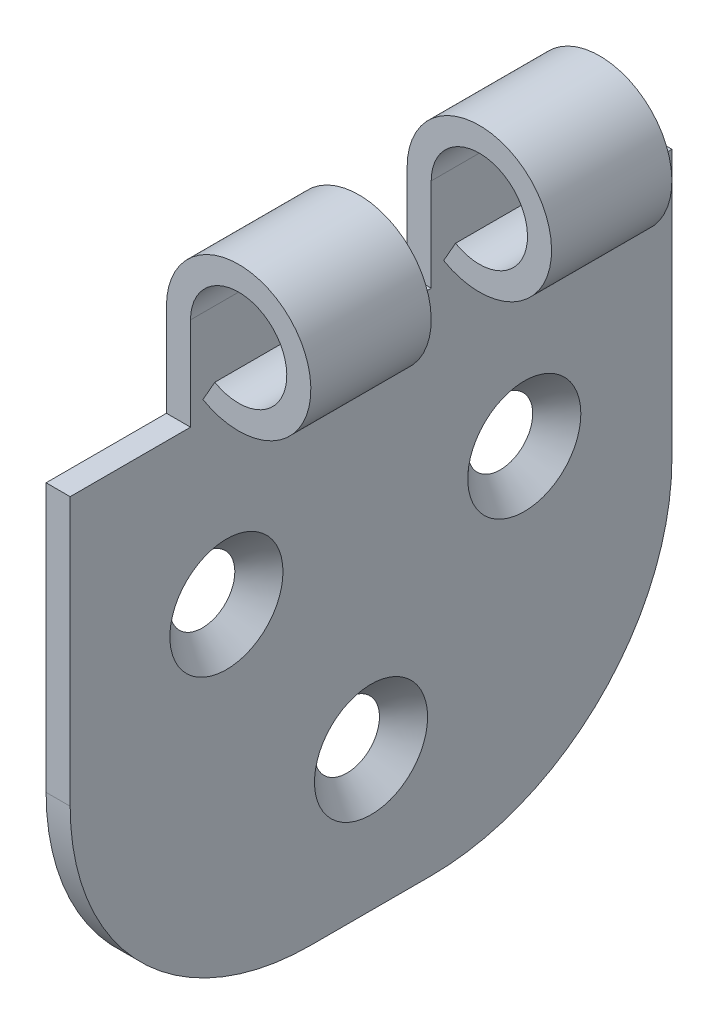
ISO-10303-21;
HEADER;
FILE_DESCRIPTION(('STEP AP214'),'2;1');
FILE_NAME('part.step','',(''),(''),'','','');
FILE_SCHEMA(('AUTOMOTIVE_DESIGN { 1 0 10303 214 1 1 1 1 }'));
ENDSEC;
DATA;
#1=APPLICATION_CONTEXT('core data for automotive mechanical design processes');
#2=APPLICATION_PROTOCOL_DEFINITION('international standard','automotive_design',2000,#1);
#3=PRODUCT_CONTEXT('',#1,'mechanical');
#4=PRODUCT('Part','Part','',(#3));
#5=PRODUCT_RELATED_PRODUCT_CATEGORY('part','',(#4));
#6=PRODUCT_DEFINITION_FORMATION('','',#4);
#7=PRODUCT_DEFINITION_CONTEXT('part definition',#1,'design');
#8=PRODUCT_DEFINITION('design','',#6,#7);
#9=PRODUCT_DEFINITION_SHAPE('','',#8);
#10=(LENGTH_UNIT() NAMED_UNIT(*) SI_UNIT(.MILLI.,.METRE.));
#11=(NAMED_UNIT(*) PLANE_ANGLE_UNIT() SI_UNIT($,.RADIAN.));
#12=(NAMED_UNIT(*) SI_UNIT($,.STERADIAN.) SOLID_ANGLE_UNIT());
#13=UNCERTAINTY_MEASURE_WITH_UNIT(LENGTH_MEASURE(1.E-05),#10,'distance_accuracy_value','');
#14=(GEOMETRIC_REPRESENTATION_CONTEXT(3) GLOBAL_UNCERTAINTY_ASSIGNED_CONTEXT((#13)) GLOBAL_UNIT_ASSIGNED_CONTEXT((#10,
#11,#12)) REPRESENTATION_CONTEXT('',''));
#15=CARTESIAN_POINT('',(0.,0.,0.));
#16=DIRECTION('',(0.,0.,1.));
#17=DIRECTION('',(1.,0.,0.));
#18=AXIS2_PLACEMENT_3D('',#15,#16,#17);
#19=CARTESIAN_POINT('',(1.99999999999999,50.,25.));
#20=DIRECTION('',(-1.,0.,0.));
#21=DIRECTION('',(0.,-1.,0.));
#22=AXIS2_PLACEMENT_3D('',#19,#20,#21);
#23=PLANE('',#22);
#24=CARTESIAN_POINT('',(2.,28.0397626935268,12.0173285585912));
#25=DIRECTION('',(1.,0.,0.));
#26=DIRECTION('',(0.,0.,-1.));
#27=AXIS2_PLACEMENT_3D('',#24,#25,#26);
#28=CIRCLE('',#27,4.7);
#29=CARTESIAN_POINT('',(2.,28.0397626935268,7.3173285585912));
#30=VERTEX_POINT('',#29);
#31=EDGE_CURVE('E309',#30,#30,#28,.T.);
#32=ORIENTED_EDGE('',*,*,#31,.F.);
#33=EDGE_LOOP('',(#32));
#34=FACE_BOUND('',#33,.T.);
#35=CARTESIAN_POINT('',(2.,27.0383186469775,-12.7326457346978));
#36=DIRECTION('',(1.,0.,0.));
#37=DIRECTION('',(0.,0.,-1.));
#38=AXIS2_PLACEMENT_3D('',#35,#36,#37);
#39=CIRCLE('',#38,4.7);
#40=CARTESIAN_POINT('',(2.,27.0383186469775,-17.4326457346978));
#41=VERTEX_POINT('',#40);
#42=EDGE_CURVE('E203',#41,#41,#39,.T.);
#43=ORIENTED_EDGE('',*,*,#42,.F.);
#44=EDGE_LOOP('',(#43));
#45=FACE_BOUND('',#44,.T.);
#46=DIRECTION('',(0.,0.,-1.));
#47=VECTOR('',#46,1.);
#48=CARTESIAN_POINT('',(2.,0.,25.));
#49=LINE('',#48,#47);
#50=CARTESIAN_POINT('',(2.,0.,5.));
#51=VERTEX_POINT('',#50);
#52=CARTESIAN_POINT('',(2.,0.,-5.));
#53=VERTEX_POINT('',#52);
#54=EDGE_CURVE('E284',#51,#53,#49,.T.);
#55=ORIENTED_EDGE('',*,*,#54,.T.);
#56=CARTESIAN_POINT('',(2.,20.,-5.));
#57=DIRECTION('',(-1.,0.,0.));
#58=DIRECTION('',(0.,-1.,0.));
#59=AXIS2_PLACEMENT_3D('',#56,#57,#58);
#60=CIRCLE('',#59,20.);
#61=CARTESIAN_POINT('',(2.,20.,-25.));
#62=VERTEX_POINT('',#61);
#63=EDGE_CURVE('E301',#53,#62,#60,.F.);
#64=ORIENTED_EDGE('',*,*,#63,.T.);
#65=DIRECTION('',(0.,1.,0.));
#66=VECTOR('',#65,1.);
#67=CARTESIAN_POINT('',(1.99999999999999,50.,-25.));
#68=LINE('',#67,#66);
#69=CARTESIAN_POINT('',(1.99999999999999,42.2789868146542,-25.));
#70=VERTEX_POINT('',#69);
#71=EDGE_CURVE('E258',#62,#70,#68,.T.);
#72=ORIENTED_EDGE('',*,*,#71,.T.);
#73=DIRECTION('',(0.,0.,-1.));
#74=VECTOR('',#73,1.);
#75=CARTESIAN_POINT('',(1.99999999999999,42.2789868146542,25.));
#76=LINE('',#75,#74);
#77=CARTESIAN_POINT('',(1.99999999999999,42.2789868146542,-15.));
#78=VERTEX_POINT('',#77);
#79=EDGE_CURVE('E186',#78,#70,#76,.T.);
#80=ORIENTED_EDGE('',*,*,#79,.F.);
#81=DIRECTION('',(0.,-1.,0.));
#82=VECTOR('',#81,1.);
#83=CARTESIAN_POINT('',(1.99999999999999,50.,-15.));
#84=LINE('',#83,#82);
#85=CARTESIAN_POINT('',(1.99999999999999,50.,-15.));
#86=VERTEX_POINT('',#85);
#87=EDGE_CURVE('E231',#86,#78,#84,.T.);
#88=ORIENTED_EDGE('',*,*,#87,.F.);
#89=DIRECTION('',(0.,0.,-1.));
#90=VECTOR('',#89,1.);
#91=CARTESIAN_POINT('',(1.99999999999999,50.,25.));
#92=LINE('',#91,#90);
#93=CARTESIAN_POINT('',(1.99999999999999,50.,-5.));
#94=VERTEX_POINT('',#93);
#95=EDGE_CURVE('E280',#94,#86,#92,.T.);
#96=ORIENTED_EDGE('',*,*,#95,.F.);
#97=DIRECTION('',(0.,1.,0.));
#98=VECTOR('',#97,1.);
#99=CARTESIAN_POINT('',(1.99999999999999,50.,-5.));
#100=LINE('',#99,#98);
#101=CARTESIAN_POINT('',(1.99999999999999,42.2789868146542,-5.));
#102=VERTEX_POINT('',#101);
#103=EDGE_CURVE('E239',#102,#94,#100,.T.);
#104=ORIENTED_EDGE('',*,*,#103,.F.);
#105=DIRECTION('',(0.,0.,-1.));
#106=VECTOR('',#105,1.);
#107=CARTESIAN_POINT('',(1.99999999999999,42.2789868146542,25.));
#108=LINE('',#107,#106);
#109=CARTESIAN_POINT('',(1.99999999999999,42.2789868146542,5.));
#110=VERTEX_POINT('',#109);
#111=EDGE_CURVE('E241',#110,#102,#108,.T.);
#112=ORIENTED_EDGE('',*,*,#111,.F.);
#113=DIRECTION('',(0.,-1.,0.));
#114=VECTOR('',#113,1.);
#115=CARTESIAN_POINT('',(1.99999999999999,50.,5.));
#116=LINE('',#115,#114);
#117=CARTESIAN_POINT('',(1.99999999999999,50.,5.));
#118=VERTEX_POINT('',#117);
#119=EDGE_CURVE('E249',#118,#110,#116,.T.);
#120=ORIENTED_EDGE('',*,*,#119,.F.);
#121=CARTESIAN_POINT('',(1.99999999999999,50.,15.));
#122=VERTEX_POINT('',#121);
#123=EDGE_CURVE('E283',#122,#118,#92,.T.);
#124=ORIENTED_EDGE('',*,*,#123,.F.);
#125=DIRECTION('',(0.,1.,0.));
#126=VECTOR('',#125,1.);
#127=CARTESIAN_POINT('',(1.99999999999999,50.,15.));
#128=LINE('',#127,#126);
#129=CARTESIAN_POINT('',(1.99999999999999,42.2789868146542,15.));
#130=VERTEX_POINT('',#129);
#131=EDGE_CURVE('E256',#130,#122,#128,.T.);
#132=ORIENTED_EDGE('',*,*,#131,.F.);
#133=DIRECTION('',(0.,0.,-1.));
#134=VECTOR('',#133,1.);
#135=CARTESIAN_POINT('',(1.99999999999999,42.2789868146542,25.));
#136=LINE('',#135,#134);
#137=CARTESIAN_POINT('',(2.,42.2789868146542,25.));
#138=VERTEX_POINT('',#137);
#139=EDGE_CURVE('E183',#138,#130,#136,.T.);
#140=ORIENTED_EDGE('',*,*,#139,.F.);
#141=DIRECTION('',(0.,1.,0.));
#142=VECTOR('',#141,1.);
#143=CARTESIAN_POINT('',(1.99999999999999,50.,25.));
#144=LINE('',#143,#142);
#145=CARTESIAN_POINT('',(2.,20.,25.));
#146=VERTEX_POINT('',#145);
#147=EDGE_CURVE('E259',#146,#138,#144,.T.);
#148=ORIENTED_EDGE('',*,*,#147,.F.);
#149=CARTESIAN_POINT('',(2.,20.,5.));
#150=DIRECTION('',(-1.,0.,0.));
#151=DIRECTION('',(0.,-1.,0.));
#152=AXIS2_PLACEMENT_3D('',#149,#150,#151);
#153=CIRCLE('',#152,20.);
#154=EDGE_CURVE('E299',#146,#51,#153,.F.);
#155=ORIENTED_EDGE('',*,*,#154,.T.);
#156=EDGE_LOOP('',(#55,#64,#72,#80,#88,#96,#104,#112,#120,#124,#132,#140,#148,#155));
#157=FACE_BOUND('',#156,.T.);
#158=CARTESIAN_POINT('',(2.,11.5874676430746,0.));
#159=DIRECTION('',(1.,0.,0.));
#160=DIRECTION('',(0.,0.,-1.));
#161=AXIS2_PLACEMENT_3D('',#158,#159,#160);
#162=CIRCLE('',#161,4.7);
#163=CARTESIAN_POINT('',(2.,11.5874676430746,-4.7));
#164=VERTEX_POINT('',#163);
#165=EDGE_CURVE('E317',#164,#164,#162,.T.);
#166=ORIENTED_EDGE('',*,*,#165,.F.);
#167=EDGE_LOOP('',(#166));
#168=FACE_BOUND('',#167,.T.);
#169=ADVANCED_FACE('F45',(#34,#45,#157,#168),#23,.F.);
#170=CARTESIAN_POINT('',(0.,0.,25.));
#171=DIRECTION('',(1.,0.,0.));
#172=DIRECTION('',(0.,0.,-1.));
#173=AXIS2_PLACEMENT_3D('',#170,#171,#172);
#174=PLANE('',#173);
#175=CARTESIAN_POINT('',(0.,11.5874676430746,0.));
#176=DIRECTION('',(1.,0.,0.));
#177=DIRECTION('',(0.,0.,-1.));
#178=AXIS2_PLACEMENT_3D('',#175,#176,#177);
#179=CIRCLE('',#178,2.7);
#180=CARTESIAN_POINT('',(0.,11.5874676430746,-2.7));
#181=VERTEX_POINT('',#180);
#182=EDGE_CURVE('E49',#181,#181,#179,.T.);
#183=ORIENTED_EDGE('',*,*,#182,.T.);
#184=EDGE_LOOP('',(#183));
#185=FACE_BOUND('',#184,.T.);
#186=CARTESIAN_POINT('',(0.,28.0397626935268,12.0173285585912));
#187=DIRECTION('',(1.,0.,0.));
#188=DIRECTION('',(0.,0.,-1.));
#189=AXIS2_PLACEMENT_3D('',#186,#187,#188);
#190=CIRCLE('',#189,2.7);
#191=CARTESIAN_POINT('',(0.,28.0397626935268,9.3173285585912));
#192=VERTEX_POINT('',#191);
#193=EDGE_CURVE('E307',#192,#192,#190,.T.);
#194=ORIENTED_EDGE('',*,*,#193,.T.);
#195=EDGE_LOOP('',(#194));
#196=FACE_BOUND('',#195,.T.);
#197=CARTESIAN_POINT('',(0.,27.0383186469775,-12.7326457346978));
#198=DIRECTION('',(1.,0.,0.));
#199=DIRECTION('',(0.,0.,-1.));
#200=AXIS2_PLACEMENT_3D('',#197,#198,#199);
#201=CIRCLE('',#200,2.7);
#202=CARTESIAN_POINT('',(0.,27.0383186469775,-15.4326457346978));
#203=VERTEX_POINT('',#202);
#204=EDGE_CURVE('E218',#203,#203,#201,.T.);
#205=ORIENTED_EDGE('',*,*,#204,.T.);
#206=EDGE_LOOP('',(#205));
#207=FACE_BOUND('',#206,.T.);
#208=DIRECTION('',(0.,-1.,0.));
#209=VECTOR('',#208,1.);
#210=CARTESIAN_POINT('',(0.,0.,-25.));
#211=LINE('',#210,#209);
#212=CARTESIAN_POINT('',(0.,42.2789868146542,-25.));
#213=VERTEX_POINT('',#212);
#214=CARTESIAN_POINT('',(0.,20.,-25.));
#215=VERTEX_POINT('',#214);
#216=EDGE_CURVE('E261',#213,#215,#211,.T.);
#217=ORIENTED_EDGE('',*,*,#216,.T.);
#218=CARTESIAN_POINT('',(0.,20.,-5.));
#219=DIRECTION('',(1.,0.,0.));
#220=DIRECTION('',(0.,0.,-1.));
#221=AXIS2_PLACEMENT_3D('',#218,#219,#220);
#222=CIRCLE('',#221,20.);
#223=CARTESIAN_POINT('',(0.,0.,-5.));
#224=VERTEX_POINT('',#223);
#225=EDGE_CURVE('E54',#215,#224,#222,.F.);
#226=ORIENTED_EDGE('',*,*,#225,.T.);
#227=DIRECTION('',(0.,0.,-1.));
#228=VECTOR('',#227,1.);
#229=CARTESIAN_POINT('',(0.,0.,25.));
#230=LINE('',#229,#228);
#231=CARTESIAN_POINT('',(0.,0.,5.));
#232=VERTEX_POINT('',#231);
#233=EDGE_CURVE('E263',#232,#224,#230,.T.);
#234=ORIENTED_EDGE('',*,*,#233,.F.);
#235=CARTESIAN_POINT('',(0.,20.,5.));
#236=DIRECTION('',(1.,0.,0.));
#237=DIRECTION('',(0.,0.,-1.));
#238=AXIS2_PLACEMENT_3D('',#235,#236,#237);
#239=CIRCLE('',#238,20.);
#240=CARTESIAN_POINT('',(0.,20.,25.));
#241=VERTEX_POINT('',#240);
#242=EDGE_CURVE('E62',#232,#241,#239,.F.);
#243=ORIENTED_EDGE('',*,*,#242,.T.);
#244=DIRECTION('',(0.,-1.,0.));
#245=VECTOR('',#244,1.);
#246=CARTESIAN_POINT('',(0.,0.,25.));
#247=LINE('',#246,#245);
#248=CARTESIAN_POINT('',(0.,42.2789868146542,25.));
#249=VERTEX_POINT('',#248);
#250=EDGE_CURVE('E197',#249,#241,#247,.T.);
#251=ORIENTED_EDGE('',*,*,#250,.F.);
#252=DIRECTION('',(0.,0.,-1.));
#253=VECTOR('',#252,1.);
#254=CARTESIAN_POINT('',(0.,42.2789868146542,28.1751448411627));
#255=LINE('',#254,#253);
#256=CARTESIAN_POINT('',(0.,42.2789868146542,15.));
#257=VERTEX_POINT('',#256);
#258=EDGE_CURVE('E180',#249,#257,#255,.T.);
#259=ORIENTED_EDGE('',*,*,#258,.T.);
#260=DIRECTION('',(0.,1.,0.));
#261=VECTOR('',#260,1.);
#262=CARTESIAN_POINT('',(0.,61.0425733554984,15.));
#263=LINE('',#262,#261);
#264=CARTESIAN_POINT('',(0.,50.,15.));
#265=VERTEX_POINT('',#264);
#266=EDGE_CURVE('E187',#257,#265,#263,.T.);
#267=ORIENTED_EDGE('',*,*,#266,.T.);
#268=DIRECTION('',(0.,0.,-1.));
#269=VECTOR('',#268,1.);
#270=CARTESIAN_POINT('',(0.,50.,25.));
#271=LINE('',#270,#269);
#272=CARTESIAN_POINT('',(0.,50.,5.));
#273=VERTEX_POINT('',#272);
#274=EDGE_CURVE('E271',#265,#273,#271,.T.);
#275=ORIENTED_EDGE('',*,*,#274,.T.);
#276=DIRECTION('',(0.,1.,0.));
#277=VECTOR('',#276,1.);
#278=CARTESIAN_POINT('',(0.,0.,5.));
#279=LINE('',#278,#277);
#280=CARTESIAN_POINT('',(0.,42.2789868146542,5.));
#281=VERTEX_POINT('',#280);
#282=EDGE_CURVE('E291',#281,#273,#279,.T.);
#283=ORIENTED_EDGE('',*,*,#282,.F.);
#284=DIRECTION('',(0.,0.,-1.));
#285=VECTOR('',#284,1.);
#286=CARTESIAN_POINT('',(0.,42.2789868146542,5.));
#287=LINE('',#286,#285);
#288=CARTESIAN_POINT('',(0.,42.2789868146542,-5.));
#289=VERTEX_POINT('',#288);
#290=EDGE_CURVE('E206',#281,#289,#287,.T.);
#291=ORIENTED_EDGE('',*,*,#290,.T.);
#292=DIRECTION('',(0.,1.,0.));
#293=VECTOR('',#292,1.);
#294=CARTESIAN_POINT('',(0.,61.0425733554984,-5.));
#295=LINE('',#294,#293);
#296=CARTESIAN_POINT('',(0.,50.,-5.));
#297=VERTEX_POINT('',#296);
#298=EDGE_CURVE('E209',#289,#297,#295,.T.);
#299=ORIENTED_EDGE('',*,*,#298,.T.);
#300=CARTESIAN_POINT('',(0.,50.,-15.));
#301=VERTEX_POINT('',#300);
#302=EDGE_CURVE('E268',#297,#301,#271,.T.);
#303=ORIENTED_EDGE('',*,*,#302,.T.);
#304=DIRECTION('',(0.,-1.,0.));
#305=VECTOR('',#304,1.);
#306=CARTESIAN_POINT('',(0.,61.0425733554984,-15.));
#307=LINE('',#306,#305);
#308=CARTESIAN_POINT('',(0.,42.2789868146542,-15.));
#309=VERTEX_POINT('',#308);
#310=EDGE_CURVE('E214',#301,#309,#307,.T.);
#311=ORIENTED_EDGE('',*,*,#310,.T.);
#312=DIRECTION('',(0.,0.,-1.));
#313=VECTOR('',#312,1.);
#314=CARTESIAN_POINT('',(0.,42.2789868146542,-15.));
#315=LINE('',#314,#313);
#316=EDGE_CURVE('E217',#309,#213,#315,.T.);
#317=ORIENTED_EDGE('',*,*,#316,.T.);
#318=EDGE_LOOP('',(#217,#226,#234,#243,#251,#259,#267,#275,#283,#291,#299,#303,#311,#317));
#319=FACE_BOUND('',#318,.T.);
#320=ADVANCED_FACE('F196',(#185,#196,#207,#319),#174,.F.);
#321=CARTESIAN_POINT('',(6.,50.,25.));
#322=DIRECTION('',(0.,0.,-1.));
#323=DIRECTION('',(-1.,0.,0.));
#324=AXIS2_PLACEMENT_3D('',#321,#322,#323);
#325=CYLINDRICAL_SURFACE('',#324,4.00000000000001);
#326=CARTESIAN_POINT('',(6.,50.,15.));
#327=DIRECTION('',(0.,0.,1.));
#328=DIRECTION('',(1.,0.,0.));
#329=AXIS2_PLACEMENT_3D('',#326,#327,#328);
#330=CIRCLE('',#329,4.00000000000001);
#331=CARTESIAN_POINT('',(4.02184665664863,46.5233767316277,15.));
#332=VERTEX_POINT('',#331);
#333=EDGE_CURVE('E254',#122,#332,#330,.F.);
#334=ORIENTED_EDGE('',*,*,#333,.F.);
#335=ORIENTED_EDGE('',*,*,#123,.T.);
#336=CARTESIAN_POINT('',(6.,50.,5.));
#337=DIRECTION('',(0.,0.,-1.));
#338=DIRECTION('',(-1.,0.,0.));
#339=AXIS2_PLACEMENT_3D('',#336,#337,#338);
#340=CIRCLE('',#339,4.00000000000001);
#341=CARTESIAN_POINT('',(4.02184665664863,46.5233767316277,5.));
#342=VERTEX_POINT('',#341);
#343=EDGE_CURVE('E247',#342,#118,#340,.F.);
#344=ORIENTED_EDGE('',*,*,#343,.F.);
#345=DIRECTION('',(0.,0.,-1.));
#346=VECTOR('',#345,1.);
#347=CARTESIAN_POINT('',(4.02184665664862,46.5233767316277,25.));
#348=LINE('',#347,#346);
#349=EDGE_CURVE('E279',#332,#342,#348,.T.);
#350=ORIENTED_EDGE('',*,*,#349,.F.);
#351=EDGE_LOOP('',(#334,#335,#344,#350));
#352=FACE_BOUND('',#351,.T.);
#353=ADVANCED_FACE('F332',(#352),#325,.F.);
#354=CARTESIAN_POINT('',(6.,50.,-5.));
#355=DIRECTION('',(0.,0.,1.));
#356=DIRECTION('',(0.,-1.,0.));
#357=AXIS2_PLACEMENT_3D('',#354,#355,#356);
#358=CIRCLE('',#357,4.00000000000001);
#359=CARTESIAN_POINT('',(4.02184665664863,46.5233767316277,-5.));
#360=VERTEX_POINT('',#359);
#361=EDGE_CURVE('E237',#94,#360,#358,.F.);
#362=ORIENTED_EDGE('',*,*,#361,.F.);
#363=ORIENTED_EDGE('',*,*,#95,.T.);
#364=CARTESIAN_POINT('',(6.,50.,-15.));
#365=DIRECTION('',(0.,0.,-1.));
#366=DIRECTION('',(0.,1.,0.));
#367=AXIS2_PLACEMENT_3D('',#364,#365,#366);
#368=CIRCLE('',#367,4.00000000000001);
#369=CARTESIAN_POINT('',(4.02184665664863,46.5233767316277,-15.));
#370=VERTEX_POINT('',#369);
#371=EDGE_CURVE('E229',#370,#86,#368,.F.);
#372=ORIENTED_EDGE('',*,*,#371,.F.);
#373=EDGE_CURVE('E276',#360,#370,#348,.T.);
#374=ORIENTED_EDGE('',*,*,#373,.F.);
#375=EDGE_LOOP('',(#362,#363,#372,#374));
#376=FACE_BOUND('',#375,.T.);
#377=ADVANCED_FACE('F410',(#376),#325,.F.);
#378=CARTESIAN_POINT('',(3.03276998497294,44.7850650974415,25.));
#379=DIRECTION('',(0.869155817093078,-0.494538335837844,0.));
#380=DIRECTION('',(0.494538335837844,0.869155817093078,0.));
#381=AXIS2_PLACEMENT_3D('',#378,#379,#380);
#382=PLANE('',#381);
#383=DIRECTION('',(-0.494538335837844,-0.869155817093078,0.));
#384=VECTOR('',#383,1.);
#385=CARTESIAN_POINT('',(3.03276998497294,44.7850650974415,15.));
#386=LINE('',#385,#384);
#387=CARTESIAN_POINT('',(3.03276998497294,44.7850650974415,15.));
#388=VERTEX_POINT('',#387);
#389=EDGE_CURVE('E252',#332,#388,#386,.T.);
#390=ORIENTED_EDGE('',*,*,#389,.F.);
#391=ORIENTED_EDGE('',*,*,#349,.T.);
#392=DIRECTION('',(0.494538335837844,0.869155817093078,0.));
#393=VECTOR('',#392,1.);
#394=CARTESIAN_POINT('',(3.03276998497294,44.7850650974415,5.));
#395=LINE('',#394,#393);
#396=CARTESIAN_POINT('',(3.03276998497294,44.7850650974415,5.));
#397=VERTEX_POINT('',#396);
#398=EDGE_CURVE('E245',#397,#342,#395,.T.);
#399=ORIENTED_EDGE('',*,*,#398,.F.);
#400=DIRECTION('',(0.,0.,-1.));
#401=VECTOR('',#400,1.);
#402=CARTESIAN_POINT('',(3.03276998497294,44.7850650974415,25.));
#403=LINE('',#402,#401);
#404=EDGE_CURVE('E275',#388,#397,#403,.T.);
#405=ORIENTED_EDGE('',*,*,#404,.F.);
#406=EDGE_LOOP('',(#390,#391,#399,#405));
#407=FACE_BOUND('',#406,.T.);
#408=ADVANCED_FACE('F376',(#407),#382,.F.);
#409=DIRECTION('',(-0.494538335837844,-0.869155817093078,0.));
#410=VECTOR('',#409,1.);
#411=CARTESIAN_POINT('',(3.03276998497294,44.7850650974415,-5.));
#412=LINE('',#411,#410);
#413=CARTESIAN_POINT('',(3.03276998497294,44.7850650974415,-5.));
#414=VERTEX_POINT('',#413);
#415=EDGE_CURVE('E235',#360,#414,#412,.T.);
#416=ORIENTED_EDGE('',*,*,#415,.F.);
#417=ORIENTED_EDGE('',*,*,#373,.T.);
#418=DIRECTION('',(0.494538335837844,0.869155817093078,0.));
#419=VECTOR('',#418,1.);
#420=CARTESIAN_POINT('',(3.03276998497294,44.7850650974415,-15.));
#421=LINE('',#420,#419);
#422=CARTESIAN_POINT('',(3.03276998497294,44.7850650974415,-15.));
#423=VERTEX_POINT('',#422);
#424=EDGE_CURVE('E227',#423,#370,#421,.T.);
#425=ORIENTED_EDGE('',*,*,#424,.F.);
#426=EDGE_CURVE('E272',#414,#423,#403,.T.);
#427=ORIENTED_EDGE('',*,*,#426,.F.);
#428=EDGE_LOOP('',(#416,#417,#425,#427));
#429=FACE_BOUND('',#428,.T.);
#430=ADVANCED_FACE('F414',(#429),#382,.F.);
#431=CARTESIAN_POINT('',(6.,50.,25.));
#432=DIRECTION('',(0.,0.,-1.));
#433=DIRECTION('',(-1.,0.,0.));
#434=AXIS2_PLACEMENT_3D('',#431,#432,#433);
#435=CYLINDRICAL_SURFACE('',#434,6.);
#436=ORIENTED_EDGE('',*,*,#274,.F.);
#437=CARTESIAN_POINT('',(6.,50.,15.));
#438=DIRECTION('',(0.,0.,1.));
#439=DIRECTION('',(1.,0.,0.));
#440=AXIS2_PLACEMENT_3D('',#437,#438,#439);
#441=CIRCLE('',#440,6.);
#442=EDGE_CURVE('E192',#388,#265,#441,.T.);
#443=ORIENTED_EDGE('',*,*,#442,.F.);
#444=ORIENTED_EDGE('',*,*,#404,.T.);
#445=CARTESIAN_POINT('',(6.,50.,5.));
#446=DIRECTION('',(0.,0.,-1.));
#447=DIRECTION('',(-1.,0.,0.));
#448=AXIS2_PLACEMENT_3D('',#445,#446,#447);
#449=CIRCLE('',#448,6.);
#450=EDGE_CURVE('E243',#273,#397,#449,.T.);
#451=ORIENTED_EDGE('',*,*,#450,.F.);
#452=EDGE_LOOP('',(#436,#443,#444,#451));
#453=FACE_BOUND('',#452,.T.);
#454=ADVANCED_FACE('F380',(#453),#435,.T.);
#455=ORIENTED_EDGE('',*,*,#302,.F.);
#456=CARTESIAN_POINT('',(6.,50.,-5.));
#457=DIRECTION('',(0.,0.,1.));
#458=DIRECTION('',(0.,-1.,0.));
#459=AXIS2_PLACEMENT_3D('',#456,#457,#458);
#460=CIRCLE('',#459,6.);
#461=EDGE_CURVE('E233',#414,#297,#460,.T.);
#462=ORIENTED_EDGE('',*,*,#461,.F.);
#463=ORIENTED_EDGE('',*,*,#426,.T.);
#464=CARTESIAN_POINT('',(6.,50.,-15.));
#465=DIRECTION('',(0.,0.,-1.));
#466=DIRECTION('',(0.,1.,0.));
#467=AXIS2_PLACEMENT_3D('',#464,#465,#466);
#468=CIRCLE('',#467,6.);
#469=EDGE_CURVE('E225',#301,#423,#468,.T.);
#470=ORIENTED_EDGE('',*,*,#469,.F.);
#471=EDGE_LOOP('',(#455,#462,#463,#470));
#472=FACE_BOUND('',#471,.T.);
#473=ADVANCED_FACE('F394',(#472),#435,.T.);
#474=CARTESIAN_POINT('',(6.,50.,25.));
#475=DIRECTION('',(0.,0.,1.));
#476=DIRECTION('',(1.,0.,0.));
#477=AXIS2_PLACEMENT_3D('',#474,#475,#476);
#478=PLANE('',#477);
#479=ORIENTED_EDGE('',*,*,#250,.T.);
#480=DIRECTION('',(1.,0.,0.));
#481=VECTOR('',#480,1.);
#482=CARTESIAN_POINT('',(2.,20.,25.));
#483=LINE('',#482,#481);
#484=EDGE_CURVE('E11',#241,#146,#483,.T.);
#485=ORIENTED_EDGE('',*,*,#484,.T.);
#486=ORIENTED_EDGE('',*,*,#147,.T.);
#487=DIRECTION('',(-1.,0.,0.));
#488=VECTOR('',#487,1.);
#489=CARTESIAN_POINT('',(6.,42.2789868146542,25.));
#490=LINE('',#489,#488);
#491=EDGE_CURVE('E289',#138,#249,#490,.T.);
#492=ORIENTED_EDGE('',*,*,#491,.T.);
#493=EDGE_LOOP('',(#479,#485,#486,#492));
#494=FACE_BOUND('',#493,.T.);
#495=ADVANCED_FACE('F363',(#494),#478,.T.);
#496=CARTESIAN_POINT('',(6.,50.,-25.));
#497=DIRECTION('',(0.,0.,1.));
#498=DIRECTION('',(1.,0.,0.));
#499=AXIS2_PLACEMENT_3D('',#496,#497,#498);
#500=PLANE('',#499);
#501=ORIENTED_EDGE('',*,*,#71,.F.);
#502=DIRECTION('',(1.,0.,0.));
#503=VECTOR('',#502,1.);
#504=CARTESIAN_POINT('',(6.,20.,-25.));
#505=LINE('',#504,#503);
#506=EDGE_CURVE('E70',#62,#215,#505,.F.);
#507=ORIENTED_EDGE('',*,*,#506,.T.);
#508=ORIENTED_EDGE('',*,*,#216,.F.);
#509=DIRECTION('',(-1.,0.,0.));
#510=VECTOR('',#509,1.);
#511=CARTESIAN_POINT('',(6.,42.2789868146542,-25.));
#512=LINE('',#511,#510);
#513=EDGE_CURVE('E287',#70,#213,#512,.T.);
#514=ORIENTED_EDGE('',*,*,#513,.F.);
#515=EDGE_LOOP('',(#501,#507,#508,#514));
#516=FACE_BOUND('',#515,.T.);
#517=ADVANCED_FACE('F342',(#516),#500,.F.);
#518=CARTESIAN_POINT('',(2.,0.,25.));
#519=DIRECTION('',(0.,1.,0.));
#520=DIRECTION('',(-1.,0.,0.));
#521=AXIS2_PLACEMENT_3D('',#518,#519,#520);
#522=PLANE('',#521);
#523=ORIENTED_EDGE('',*,*,#233,.T.);
#524=DIRECTION('',(1.,0.,0.));
#525=VECTOR('',#524,1.);
#526=CARTESIAN_POINT('',(2.,0.,-5.));
#527=LINE('',#526,#525);
#528=EDGE_CURVE('E296',#224,#53,#527,.T.);
#529=ORIENTED_EDGE('',*,*,#528,.T.);
#530=ORIENTED_EDGE('',*,*,#54,.F.);
#531=DIRECTION('',(1.,0.,0.));
#532=VECTOR('',#531,1.);
#533=CARTESIAN_POINT('',(0.,0.,5.));
#534=LINE('',#533,#532);
#535=EDGE_CURVE('E294',#51,#232,#534,.F.);
#536=ORIENTED_EDGE('',*,*,#535,.T.);
#537=EDGE_LOOP('',(#523,#529,#530,#536));
#538=FACE_BOUND('',#537,.T.);
#539=ADVANCED_FACE('F339',(#538),#522,.F.);
#540=CARTESIAN_POINT('',(12.,61.0425733554984,-15.));
#541=DIRECTION('',(0.,0.,-1.));
#542=DIRECTION('',(0.,1.,0.));
#543=AXIS2_PLACEMENT_3D('',#540,#541,#542);
#544=PLANE('',#543);
#545=ORIENTED_EDGE('',*,*,#87,.T.);
#546=DIRECTION('',(-1.,0.,0.));
#547=VECTOR('',#546,1.);
#548=CARTESIAN_POINT('',(12.,42.2789868146542,-15.));
#549=LINE('',#548,#547);
#550=EDGE_CURVE('E210',#78,#309,#549,.T.);
#551=ORIENTED_EDGE('',*,*,#550,.T.);
#552=ORIENTED_EDGE('',*,*,#310,.F.);
#553=ORIENTED_EDGE('',*,*,#469,.T.);
#554=ORIENTED_EDGE('',*,*,#424,.T.);
#555=ORIENTED_EDGE('',*,*,#371,.T.);
#556=EDGE_LOOP('',(#545,#551,#552,#553,#554,#555));
#557=FACE_BOUND('',#556,.T.);
#558=ADVANCED_FACE('F341',(#557),#544,.T.);
#559=CARTESIAN_POINT('',(12.,42.2789868146542,-15.));
#560=DIRECTION('',(0.,1.,0.));
#561=DIRECTION('',(-1.,0.,0.));
#562=AXIS2_PLACEMENT_3D('',#559,#560,#561);
#563=PLANE('',#562);
#564=ORIENTED_EDGE('',*,*,#79,.T.);
#565=ORIENTED_EDGE('',*,*,#513,.T.);
#566=ORIENTED_EDGE('',*,*,#316,.F.);
#567=ORIENTED_EDGE('',*,*,#550,.F.);
#568=EDGE_LOOP('',(#564,#565,#566,#567));
#569=FACE_BOUND('',#568,.T.);
#570=ADVANCED_FACE('F403',(#569),#563,.T.);
#571=CARTESIAN_POINT('',(12.,61.0425733554984,15.));
#572=DIRECTION('',(0.,0.,1.));
#573=DIRECTION('',(1.,0.,0.));
#574=AXIS2_PLACEMENT_3D('',#571,#572,#573);
#575=PLANE('',#574);
#576=ORIENTED_EDGE('',*,*,#131,.T.);
#577=ORIENTED_EDGE('',*,*,#333,.T.);
#578=ORIENTED_EDGE('',*,*,#389,.T.);
#579=ORIENTED_EDGE('',*,*,#442,.T.);
#580=ORIENTED_EDGE('',*,*,#266,.F.);
#581=DIRECTION('',(-1.,0.,0.));
#582=VECTOR('',#581,1.);
#583=CARTESIAN_POINT('',(12.,42.2789868146542,15.));
#584=LINE('',#583,#582);
#585=EDGE_CURVE('E175',#130,#257,#584,.T.);
#586=ORIENTED_EDGE('',*,*,#585,.F.);
#587=EDGE_LOOP('',(#576,#577,#578,#579,#580,#586));
#588=FACE_BOUND('',#587,.T.);
#589=ADVANCED_FACE('F190',(#588),#575,.T.);
#590=CARTESIAN_POINT('',(12.,42.2789868146542,28.1751448411627));
#591=DIRECTION('',(0.,1.,0.));
#592=DIRECTION('',(-1.,0.,0.));
#593=AXIS2_PLACEMENT_3D('',#590,#591,#592);
#594=PLANE('',#593);
#595=ORIENTED_EDGE('',*,*,#139,.T.);
#596=ORIENTED_EDGE('',*,*,#585,.T.);
#597=ORIENTED_EDGE('',*,*,#258,.F.);
#598=ORIENTED_EDGE('',*,*,#491,.F.);
#599=EDGE_LOOP('',(#595,#596,#597,#598));
#600=FACE_BOUND('',#599,.T.);
#601=ADVANCED_FACE('F177',(#600),#594,.T.);
#602=CARTESIAN_POINT('',(12.,61.0425733554984,5.));
#603=DIRECTION('',(0.,0.,-1.));
#604=DIRECTION('',(-1.,0.,0.));
#605=AXIS2_PLACEMENT_3D('',#602,#603,#604);
#606=PLANE('',#605);
#607=ORIENTED_EDGE('',*,*,#119,.T.);
#608=DIRECTION('',(-1.,0.,0.));
#609=VECTOR('',#608,1.);
#610=CARTESIAN_POINT('',(12.,42.2789868146542,5.));
#611=LINE('',#610,#609);
#612=EDGE_CURVE('E198',#110,#281,#611,.T.);
#613=ORIENTED_EDGE('',*,*,#612,.T.);
#614=ORIENTED_EDGE('',*,*,#282,.T.);
#615=ORIENTED_EDGE('',*,*,#450,.T.);
#616=ORIENTED_EDGE('',*,*,#398,.T.);
#617=ORIENTED_EDGE('',*,*,#343,.T.);
#618=EDGE_LOOP('',(#607,#613,#614,#615,#616,#617));
#619=FACE_BOUND('',#618,.T.);
#620=ADVANCED_FACE('F384',(#619),#606,.T.);
#621=CARTESIAN_POINT('',(12.,42.2789868146542,5.));
#622=DIRECTION('',(0.,1.,0.));
#623=DIRECTION('',(-1.,0.,0.));
#624=AXIS2_PLACEMENT_3D('',#621,#622,#623);
#625=PLANE('',#624);
#626=ORIENTED_EDGE('',*,*,#111,.T.);
#627=DIRECTION('',(-1.,0.,0.));
#628=VECTOR('',#627,1.);
#629=CARTESIAN_POINT('',(12.,42.2789868146542,-5.));
#630=LINE('',#629,#628);
#631=EDGE_CURVE('E200',#102,#289,#630,.T.);
#632=ORIENTED_EDGE('',*,*,#631,.T.);
#633=ORIENTED_EDGE('',*,*,#290,.F.);
#634=ORIENTED_EDGE('',*,*,#612,.F.);
#635=EDGE_LOOP('',(#626,#632,#633,#634));
#636=FACE_BOUND('',#635,.T.);
#637=ADVANCED_FACE('F353',(#636),#625,.T.);
#638=CARTESIAN_POINT('',(12.,61.0425733554984,-5.));
#639=DIRECTION('',(0.,0.,1.));
#640=DIRECTION('',(0.,-1.,0.));
#641=AXIS2_PLACEMENT_3D('',#638,#639,#640);
#642=PLANE('',#641);
#643=ORIENTED_EDGE('',*,*,#103,.T.);
#644=ORIENTED_EDGE('',*,*,#361,.T.);
#645=ORIENTED_EDGE('',*,*,#415,.T.);
#646=ORIENTED_EDGE('',*,*,#461,.T.);
#647=ORIENTED_EDGE('',*,*,#298,.F.);
#648=ORIENTED_EDGE('',*,*,#631,.F.);
#649=EDGE_LOOP('',(#643,#644,#645,#646,#647,#648));
#650=FACE_BOUND('',#649,.T.);
#651=ADVANCED_FACE('F346',(#650),#642,.T.);
#652=CARTESIAN_POINT('',(2.,20.,-5.));
#653=DIRECTION('',(1.,0.,0.));
#654=DIRECTION('',(0.,1.,0.));
#655=AXIS2_PLACEMENT_3D('',#652,#653,#654);
#656=CYLINDRICAL_SURFACE('',#655,20.);
#657=ORIENTED_EDGE('',*,*,#225,.F.);
#658=ORIENTED_EDGE('',*,*,#506,.F.);
#659=ORIENTED_EDGE('',*,*,#63,.F.);
#660=ORIENTED_EDGE('',*,*,#528,.F.);
#661=EDGE_LOOP('',(#657,#658,#659,#660));
#662=FACE_BOUND('',#661,.T.);
#663=ADVANCED_FACE('F344',(#662),#656,.T.);
#664=CARTESIAN_POINT('',(6.,20.,5.));
#665=DIRECTION('',(-1.,0.,0.));
#666=DIRECTION('',(0.,-1.,0.));
#667=AXIS2_PLACEMENT_3D('',#664,#665,#666);
#668=CYLINDRICAL_SURFACE('',#667,20.);
#669=ORIENTED_EDGE('',*,*,#242,.F.);
#670=ORIENTED_EDGE('',*,*,#535,.F.);
#671=ORIENTED_EDGE('',*,*,#154,.F.);
#672=ORIENTED_EDGE('',*,*,#484,.F.);
#673=EDGE_LOOP('',(#669,#670,#671,#672));
#674=FACE_BOUND('',#673,.T.);
#675=ADVANCED_FACE('F47',(#674),#668,.T.);
#676=CARTESIAN_POINT('',(2.,27.0383186469775,-12.7326457346978));
#677=DIRECTION('',(1.,0.,0.));
#678=DIRECTION('',(0.,0.,-1.));
#679=AXIS2_PLACEMENT_3D('',#676,#677,#678);
#680=CONICAL_SURFACE('',#679,4.7,0.785398163397448);
#681=ORIENTED_EDGE('',*,*,#42,.T.);
#682=EDGE_LOOP('',(#681));
#683=FACE_BOUND('',#682,.T.);
#684=ORIENTED_EDGE('',*,*,#204,.F.);
#685=EDGE_LOOP('',(#684));
#686=FACE_BOUND('',#685,.T.);
#687=ADVANCED_FACE('F350',(#683,#686),#680,.F.);
#688=CARTESIAN_POINT('',(2.,28.0397626935268,12.0173285585912));
#689=DIRECTION('',(1.,0.,0.));
#690=DIRECTION('',(0.,0.,-1.));
#691=AXIS2_PLACEMENT_3D('',#688,#689,#690);
#692=CONICAL_SURFACE('',#691,4.7,0.785398163397448);
#693=ORIENTED_EDGE('',*,*,#31,.T.);
#694=EDGE_LOOP('',(#693));
#695=FACE_BOUND('',#694,.T.);
#696=ORIENTED_EDGE('',*,*,#193,.F.);
#697=EDGE_LOOP('',(#696));
#698=FACE_BOUND('',#697,.T.);
#699=ADVANCED_FACE('F440',(#695,#698),#692,.F.);
#700=CARTESIAN_POINT('',(2.,11.5874676430746,0.));
#701=DIRECTION('',(1.,0.,0.));
#702=DIRECTION('',(0.,0.,-1.));
#703=AXIS2_PLACEMENT_3D('',#700,#701,#702);
#704=CONICAL_SURFACE('',#703,4.7,0.785398163397448);
#705=ORIENTED_EDGE('',*,*,#165,.T.);
#706=EDGE_LOOP('',(#705));
#707=FACE_BOUND('',#706,.T.);
#708=ORIENTED_EDGE('',*,*,#182,.F.);
#709=EDGE_LOOP('',(#708));
#710=FACE_BOUND('',#709,.T.);
#711=ADVANCED_FACE('F322',(#707,#710),#704,.F.);
#712=CLOSED_SHELL('',(#169,#320,#353,#377,#408,#430,#454,#473,#495,#517,#539,#558,#570,#589,
#601,#620,#637,#651,#663,#675,#687,#699,#711));
#713=MANIFOLD_SOLID_BREP('B2',#712);
#714=ADVANCED_BREP_SHAPE_REPRESENTATION('',(#18,#713),#14);
#715=SHAPE_DEFINITION_REPRESENTATION(#9,#714);
ENDSEC;
END-ISO-10303-21;
